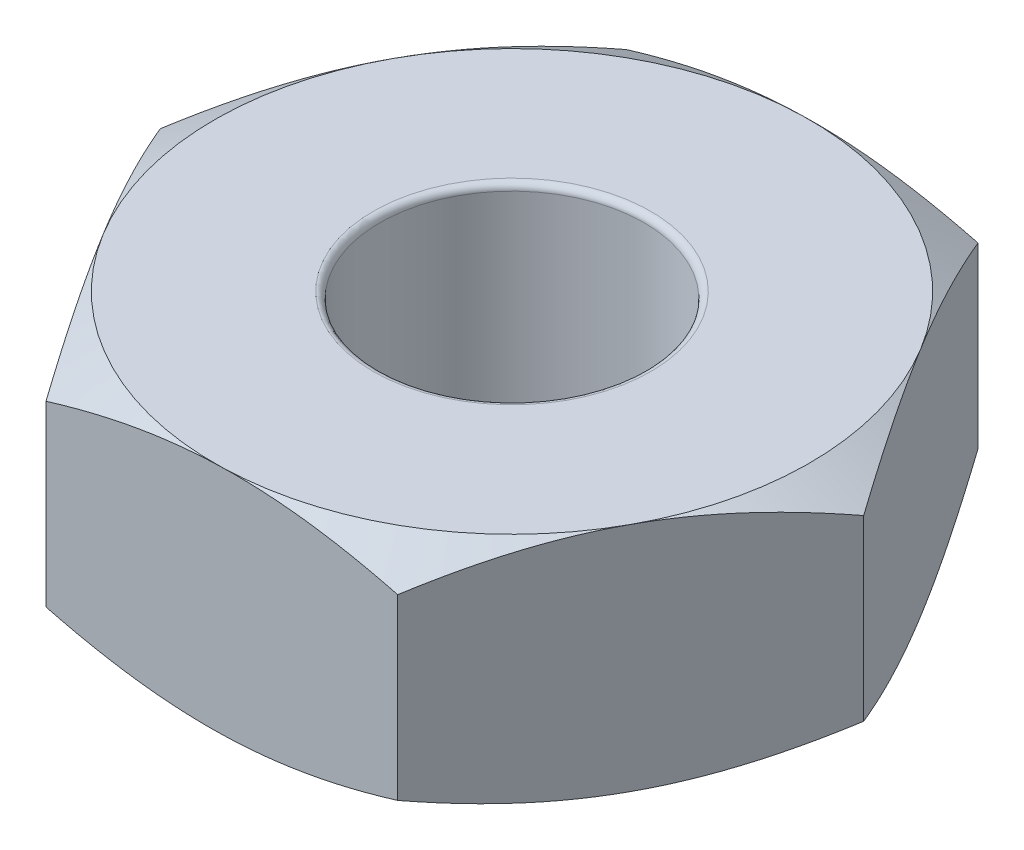
ISO-10303-21;
HEADER;
FILE_DESCRIPTION(('STEP AP214'),'2;1');
FILE_NAME('part.step','',(''),(''),'','','');
FILE_SCHEMA(('AUTOMOTIVE_DESIGN { 1 0 10303 214 1 1 1 1 }'));
ENDSEC;
DATA;
#1=APPLICATION_CONTEXT('core data for automotive mechanical design processes');
#2=APPLICATION_PROTOCOL_DEFINITION('international standard','automotive_design',2000,#1);
#3=PRODUCT_CONTEXT('',#1,'mechanical');
#4=PRODUCT('Part','Part','',(#3));
#5=PRODUCT_RELATED_PRODUCT_CATEGORY('part','',(#4));
#6=PRODUCT_DEFINITION_FORMATION('','',#4);
#7=PRODUCT_DEFINITION_CONTEXT('part definition',#1,'design');
#8=PRODUCT_DEFINITION('design','',#6,#7);
#9=PRODUCT_DEFINITION_SHAPE('','',#8);
#10=(LENGTH_UNIT() NAMED_UNIT(*) SI_UNIT(.MILLI.,.METRE.));
#11=(NAMED_UNIT(*) PLANE_ANGLE_UNIT() SI_UNIT($,.RADIAN.));
#12=(NAMED_UNIT(*) SI_UNIT($,.STERADIAN.) SOLID_ANGLE_UNIT());
#13=UNCERTAINTY_MEASURE_WITH_UNIT(LENGTH_MEASURE(1.E-05),#10,'distance_accuracy_value','');
#14=(GEOMETRIC_REPRESENTATION_CONTEXT(3) GLOBAL_UNCERTAINTY_ASSIGNED_CONTEXT((#13)) GLOBAL_UNIT_ASSIGNED_CONTEXT((#10,
#11,#12)) REPRESENTATION_CONTEXT('',''));
#15=CARTESIAN_POINT('',(0.,0.,0.));
#16=DIRECTION('',(0.,0.,1.));
#17=DIRECTION('',(1.,0.,0.));
#18=AXIS2_PLACEMENT_3D('',#15,#16,#17);
#19=CARTESIAN_POINT('',(-1.24414815732312,1.75,2.28081024257378));
#20=DIRECTION('',(-0.0242260833991026,0.,-0.999706505372022));
#21=DIRECTION('',(-0.999706505372022,0.,0.0242260833991026));
#22=AXIS2_PLACEMENT_3D('',#19,#20,#21);
#23=PLANE('',#22);
#24=CARTESIAN_POINT('',(1.35336553261908,0.201019649635317,2.21786418496117));
#25=CARTESIAN_POINT('',(1.2392259505726,0.168047394448406,2.22063015179137));
#26=CARTESIAN_POINT('',(1.12410112472943,0.138060129539284,2.22341999422733));
#27=CARTESIAN_POINT('',(0.891857888572226,0.0857165965177254,2.22904799002188));
#28=CARTESIAN_POINT('',(0.774735351050521,0.0633788464184081,2.23188624339591));
#29=CARTESIAN_POINT('',(0.541941818263342,0.028606252961392,2.2375275746364));
#30=CARTESIAN_POINT('',(0.426306644977155,0.0159399903113582,2.24032978442182));
#31=CARTESIAN_POINT('',(0.194492083865566,0.000818011110303956,2.2459473920501));
#32=CARTESIAN_POINT('',(0.0783135388495203,-0.0016502265858114,2.24876276946899));
#33=CARTESIAN_POINT('',(-0.138779970216544,0.00347945694205818,2.25402363896196));
#34=CARTESIAN_POINT('',(-0.239727401639467,0.00981786532235383,2.25646991782424));
#35=CARTESIAN_POINT('',(-0.440964580060728,0.0299084862872923,2.26134653775343));
#36=CARTESIAN_POINT('',(-0.541253630809851,0.04366756452077,2.26377686194799));
#37=CARTESIAN_POINT('',(-0.742905857206265,0.0780648199818089,2.26866353981599));
#38=CARTESIAN_POINT('',(-0.844243505302335,0.0988488331916787,2.27111927487528));
#39=CARTESIAN_POINT('',(-1.04540721139907,0.146020609597032,2.27599411433525));
#40=CARTESIAN_POINT('',(-1.14523584741224,0.172397286148404,2.2784132812094));
#41=CARTESIAN_POINT('',(-1.24434815732312,0.201019649635317,2.28081508921293));
#42=B_SPLINE_CURVE_WITH_KNOTS('',3,(#24,#25,#26,#27,#28,#29,#30,#31,#32,#33,#34,#35,#36,#37,#38,
#39,#40,#41),.UNSPECIFIED.,.F.,.F.,(4,2,2,2,2,2,2,2,4),(0.,0.356656711380072,0.714170816042071,
1.06283621827876,1.41107340134424,1.71431219010751,2.01783201974146,2.32808519638575,
2.63772899709812),.UNSPECIFIED.);
#43=CARTESIAN_POINT('',(1.35316553261908,0.200961894323341,2.21786903160031));
#44=VERTEX_POINT('',#43);
#45=CARTESIAN_POINT('',(0.0545086876479809,0.,2.24933963708705));
#46=VERTEX_POINT('',#45);
#47=EDGE_CURVE('E135',#44,#46,#42,.T.);
#48=ORIENTED_EDGE('',*,*,#47,.F.);
#49=DIRECTION('',(0.,-1.,0.));
#50=VECTOR('',#49,1.);
#51=CARTESIAN_POINT('',(1.35316553261908,1.75,2.21786903160031));
#52=LINE('',#51,#50);
#53=CARTESIAN_POINT('',(1.35316553261908,1.54903810567666,2.21786903160031));
#54=VERTEX_POINT('',#53);
#55=EDGE_CURVE('E248',#54,#44,#52,.T.);
#56=ORIENTED_EDGE('',*,*,#55,.F.);
#57=CARTESIAN_POINT('',(-1.24434815732312,1.54898035036468,2.28081508921293));
#58=CARTESIAN_POINT('',(-1.13020857527664,1.58195260555159,2.27804912238272));
#59=CARTESIAN_POINT('',(-1.01508374943347,1.61193987046072,2.27525927994677));
#60=CARTESIAN_POINT('',(-0.782840513276265,1.66428340348227,2.26963128415222));
#61=CARTESIAN_POINT('',(-0.665717975754561,1.68662115358159,2.26679303077818));
#62=CARTESIAN_POINT('',(-0.432924442967381,1.72139374703861,2.2611516995377));
#63=CARTESIAN_POINT('',(-0.317289269681194,1.73406000968864,2.25834948975228));
#64=CARTESIAN_POINT('',(-0.085474708569605,1.7491819888897,2.252731882124));
#65=CARTESIAN_POINT('',(0.0307038364464405,1.75165022658581,2.24991650470511));
#66=CARTESIAN_POINT('',(0.247797345512505,1.74652054305794,2.24465563521213));
#67=CARTESIAN_POINT('',(0.348744776935427,1.74018213467765,2.24220935634985));
#68=CARTESIAN_POINT('',(0.549981955356688,1.72009151371271,2.23733273642067));
#69=CARTESIAN_POINT('',(0.650271006105811,1.70633243547923,2.23490241222611));
#70=CARTESIAN_POINT('',(0.851923232502226,1.67193518001819,2.23001573435811));
#71=CARTESIAN_POINT('',(0.953260880598296,1.65115116680832,2.22755999929882));
#72=CARTESIAN_POINT('',(1.15442458669503,1.60397939040297,2.22268515983885));
#73=CARTESIAN_POINT('',(1.2542532227082,1.5776027138516,2.2202659929647));
#74=CARTESIAN_POINT('',(1.35336553261908,1.54898035036468,2.21786418496117));
#75=B_SPLINE_CURVE_WITH_KNOTS('',3,(#57,#58,#59,#60,#61,#62,#63,#64,#65,#66,#67,#68,#69,#70,#71,
#72,#73,#74),.UNSPECIFIED.,.F.,.F.,(4,2,2,2,2,2,2,2,4),(0.,0.356656711380072,0.714170816042071,
1.06283621827877,1.41107340134425,1.71431219010751,2.01783201974146,2.32808519638575,
2.63772899709812),.UNSPECIFIED.);
#76=CARTESIAN_POINT('',(0.0545086876479809,1.75,2.24933963708705));
#77=VERTEX_POINT('',#76);
#78=EDGE_CURVE('E421',#77,#54,#75,.T.);
#79=ORIENTED_EDGE('',*,*,#78,.F.);
#80=CARTESIAN_POINT('',(-1.24414815732312,1.54903810567666,2.28081024257378));
#81=VERTEX_POINT('',#80);
#82=EDGE_CURVE('E407',#81,#77,#75,.T.);
#83=ORIENTED_EDGE('',*,*,#82,.F.);
#84=DIRECTION('',(0.,-1.,0.));
#85=VECTOR('',#84,1.);
#86=CARTESIAN_POINT('',(-1.24414815732312,1.75,2.28081024257378));
#87=LINE('',#86,#85);
#88=CARTESIAN_POINT('',(-1.24414815732312,0.200961894323341,2.28081024257378));
#89=VERTEX_POINT('',#88);
#90=EDGE_CURVE('E173',#81,#89,#87,.T.);
#91=ORIENTED_EDGE('',*,*,#90,.T.);
#92=EDGE_CURVE('E149',#46,#89,#42,.T.);
#93=ORIENTED_EDGE('',*,*,#92,.F.);
#94=EDGE_LOOP('',(#48,#56,#79,#83,#91,#93));
#95=FACE_BOUND('',#94,.T.);
#96=ADVANCED_FACE('F45',(#95),#23,.F.);
#97=CARTESIAN_POINT('',(1.35316553261908,1.75,2.21786903160031));
#98=DIRECTION('',(-0.877884271680286,0.,-0.478872849028187));
#99=DIRECTION('',(-0.478872849028188,0.,0.877884271680286));
#100=AXIS2_PLACEMENT_3D('',#97,#98,#99);
#101=PLANE('',#100);
#102=CARTESIAN_POINT('',(2.59742278697572,0.201027664750746,-0.0631412109734704));
#103=CARTESIAN_POINT('',(2.54274816911693,0.168054751331238,0.0370899614050852));
#104=CARTESIAN_POINT('',(2.48760160480089,0.13806678726465,0.138186320383265));
#105=CARTESIAN_POINT('',(2.37635350022435,0.0857218031429434,0.342129729286452));
#106=CARTESIAN_POINT('',(2.32024998283202,0.0633833020133519,0.444980403749666));
#107=CARTESIAN_POINT('',(2.20873826610772,0.0286092238229332,0.649407074459846));
#108=CARTESIAN_POINT('',(2.15334722697362,0.0159422229400709,0.750951612110147));
#109=CARTESIAN_POINT('',(2.04230443514268,0.000818816864933552,0.954518635443553));
#110=CARTESIAN_POINT('',(1.98665308621816,-0.00165011007630418,1.05654038091894));
#111=CARTESIAN_POINT('',(1.88266013136103,0.00347848396653262,1.24718342869227));
#112=CARTESIAN_POINT('',(1.83430298004151,0.00981675884907256,1.33583322926631));
#113=CARTESIAN_POINT('',(1.73790373292515,0.0299077409451317,1.51255526104785));
#114=CARTESIAN_POINT('',(1.68986197070406,0.0436673152428587,1.60062688073413));
#115=CARTESIAN_POINT('',(1.59326386997476,0.0780661193384383,1.777713457007));
#116=CARTESIAN_POINT('',(1.54471976124752,0.0988512050500394,1.86670599358715));
#117=CARTESIAN_POINT('',(1.44835568410154,0.14602553399345,2.04336355070931));
#118=CARTESIAN_POINT('',(1.40053448053916,0.172403688555852,2.13103083555418));
#119=CARTESIAN_POINT('',(1.35305643558557,0.201027664750746,2.21806903160031));
#120=B_SPLINE_CURVE_WITH_KNOTS('',3,(#102,#103,#104,#105,#106,#107,#108,#109,#110,#111,#112,
#113,#114,#115,#116,#117,#118,#119),.UNSPECIFIED.,.F.,.F.,(4,2,2,2,2,2,2,2,4),(0.,
0.356658612393827,0.714174670128739,1.0628417917424,1.41108067343755,1.71433174766822,
2.01786390910348,2.32813007022043,2.63778676329003),.UNSPECIFIED.);
#121=CARTESIAN_POINT('',(2.59731368994221,0.200961894323341,-0.0629412109734703));
#122=VERTEX_POINT('',#121);
#123=CARTESIAN_POINT('',(1.97523961128064,0.,1.07746391031342));
#124=VERTEX_POINT('',#123);
#125=EDGE_CURVE('E61',#122,#124,#120,.T.);
#126=ORIENTED_EDGE('',*,*,#125,.F.);
#127=DIRECTION('',(0.,-1.,0.));
#128=VECTOR('',#127,1.);
#129=CARTESIAN_POINT('',(2.59731368994221,1.75,-0.0629412109734704));
#130=LINE('',#129,#128);
#131=CARTESIAN_POINT('',(2.59731368994221,1.54903810567666,-0.0629412109734704));
#132=VERTEX_POINT('',#131);
#133=EDGE_CURVE('E411',#132,#122,#130,.T.);
#134=ORIENTED_EDGE('',*,*,#133,.F.);
#135=CARTESIAN_POINT('',(1.35305643558557,1.54897233524925,2.21806903160031));
#136=CARTESIAN_POINT('',(1.40773105344435,1.58194524866876,2.11783785922176));
#137=CARTESIAN_POINT('',(1.4628776177604,1.61193321273535,2.01674150024358));
#138=CARTESIAN_POINT('',(1.57412572233694,1.66427819685706,1.81279809134039));
#139=CARTESIAN_POINT('',(1.63022923972927,1.68661669798665,1.70994741687718));
#140=CARTESIAN_POINT('',(1.74174095645357,1.72139077617707,1.505520746167));
#141=CARTESIAN_POINT('',(1.79713199558767,1.73405777705993,1.4039762085167));
#142=CARTESIAN_POINT('',(1.90817478741861,1.74918118313507,1.20040918518329));
#143=CARTESIAN_POINT('',(1.96382613634313,1.7516501100763,1.0983874397079));
#144=CARTESIAN_POINT('',(2.06781909120026,1.74652151603347,0.907744391934576));
#145=CARTESIAN_POINT('',(2.11617624251978,1.74018324115093,0.819094591360529));
#146=CARTESIAN_POINT('',(2.21257548963614,1.72009225905487,0.642372559578993));
#147=CARTESIAN_POINT('',(2.26061725185723,1.70633268475714,0.554300939892715));
#148=CARTESIAN_POINT('',(2.35721535258653,1.67193388066156,0.377214363619842));
#149=CARTESIAN_POINT('',(2.40575946131376,1.65114879494996,0.288221827039693));
#150=CARTESIAN_POINT('',(2.50212353845975,1.60397446600655,0.111564269917535));
#151=CARTESIAN_POINT('',(2.54994474202212,1.57759631144415,0.0238969850726663));
#152=CARTESIAN_POINT('',(2.59742278697572,1.54897233524925,-0.0631412109734705));
#153=B_SPLINE_CURVE_WITH_KNOTS('',3,(#135,#136,#137,#138,#139,#140,#141,#142,#143,#144,#145,
#146,#147,#148,#149,#150,#151,#152),.UNSPECIFIED.,.F.,.F.,(4,2,2,2,2,2,2,2,4),(0.,
0.356658612393827,0.714174670128739,1.0628417917424,1.41108067343755,1.71433174766822,
2.01786390910348,2.32813007022043,2.63778676329003),.UNSPECIFIED.);
#154=CARTESIAN_POINT('',(1.97523961128064,1.75,1.07746391031342));
#155=VERTEX_POINT('',#154);
#156=EDGE_CURVE('E298',#155,#132,#153,.T.);
#157=ORIENTED_EDGE('',*,*,#156,.F.);
#158=EDGE_CURVE('E420',#54,#155,#153,.T.);
#159=ORIENTED_EDGE('',*,*,#158,.F.);
#160=ORIENTED_EDGE('',*,*,#55,.T.);
#161=EDGE_CURVE('E142',#124,#44,#120,.T.);
#162=ORIENTED_EDGE('',*,*,#161,.F.);
#163=EDGE_LOOP('',(#126,#134,#157,#159,#160,#162));
#164=FACE_BOUND('',#163,.T.);
#165=ADVANCED_FACE('F283',(#164),#101,.F.);
#166=CARTESIAN_POINT('',(2.59731368994221,1.75,-0.0629412109734704));
#167=DIRECTION('',(-0.853658188281184,0.,0.520833656343834));
#168=DIRECTION('',(0.520833656343834,0.,0.853658188281184));
#169=AXIS2_PLACEMENT_3D('',#166,#167,#168);
#170=PLANE('',#169);
#171=CARTESIAN_POINT('',(1.24402613338813,0.201029531384988,-2.28101024257378));
#172=CARTESIAN_POINT('',(1.3034916228234,0.168056464671943,-2.18354495522483));
#173=CARTESIAN_POINT('',(1.36347041296902,0.138068337780994,-2.08523835635709));
#174=CARTESIAN_POINT('',(1.48446665374401,0.0857230157174111,-1.88692277050597));
#175=CARTESIAN_POINT('',(1.54548625478608,0.0633843396827904,-1.78691025894733));
#176=CARTESIAN_POINT('',(1.6667692096972,0.0286099157173191,-1.58812474211724));
#177=CARTESIAN_POINT('',(1.72701389947093,0.0159427429095415,-1.48938232772177));
#178=CARTESIAN_POINT('',(1.84778684433711,0.000819004533354107,-1.29143272893512));
#179=CARTESIAN_POINT('',(1.90831466026302,-0.00165008292465321,-1.19222626434786));
#180=CARTESIAN_POINT('',(2.02142047439859,0.00347825738428889,-1.00684326691096));
#181=CARTESIAN_POINT('',(2.07401537839305,0.00981650117229507,-0.92063902509619));
#182=CARTESIAN_POINT('',(2.17886252038582,0.0299075673656625,-0.74879217881458));
#183=CARTESIAN_POINT('',(2.23111439556314,0.0436672571895414,-0.663150169019585));
#184=CARTESIAN_POINT('',(2.33617782568627,0.0780664219434196,-0.490948821581496));
#185=CARTESIAN_POINT('',(2.38897607878643,0.0988517574292066,-0.404411285965429));
#186=CARTESIAN_POINT('',(2.49378497521699,0.146026680831881,-0.232627125028653));
#187=CARTESIAN_POINT('',(2.54579696198041,0.172405179607658,-0.147378297790703));
#188=CARTESIAN_POINT('',(2.59743571387719,0.201029531384988,-0.0627412109734703));
#189=B_SPLINE_CURVE_WITH_KNOTS('',3,(#171,#172,#173,#174,#175,#176,#177,#178,#179,#180,#181,
#182,#183,#184,#185,#186,#187,#188),.UNSPECIFIED.,.F.,.F.,(4,2,2,2,2,2,2,2,4),(0.,
0.356659055119231,0.714175567703559,1.06284308974171,1.41108236702949,1.71433630238094,
2.01787133572819,2.32814052076081,2.63780021629238),.UNSPECIFIED.);
#190=CARTESIAN_POINT('',(1.24414815732312,0.200961894323341,-2.28081024257378));
#191=VERTEX_POINT('',#190);
#192=CARTESIAN_POINT('',(1.92073092363266,0.,-1.17187572677363));
#193=VERTEX_POINT('',#192);
#194=EDGE_CURVE('E69',#191,#193,#189,.T.);
#195=ORIENTED_EDGE('',*,*,#194,.F.);
#196=DIRECTION('',(0.,-1.,0.));
#197=VECTOR('',#196,1.);
#198=CARTESIAN_POINT('',(1.24414815732312,1.75,-2.28081024257378));
#199=LINE('',#198,#197);
#200=CARTESIAN_POINT('',(1.24414815732312,1.54903810567666,-2.28081024257378));
#201=VERTEX_POINT('',#200);
#202=EDGE_CURVE('E405',#201,#191,#199,.T.);
#203=ORIENTED_EDGE('',*,*,#202,.F.);
#204=CARTESIAN_POINT('',(2.59743571387719,1.54897046861501,-0.0627412109734704));
#205=CARTESIAN_POINT('',(2.53797022444193,1.58194353532806,-0.160206498322428));
#206=CARTESIAN_POINT('',(2.47799143429631,1.61193166221901,-0.25851309719016));
#207=CARTESIAN_POINT('',(2.35699519352132,1.66427698428259,-0.456828683041287));
#208=CARTESIAN_POINT('',(2.29597559247925,1.68661566031721,-0.556841194599921));
#209=CARTESIAN_POINT('',(2.17469263756813,1.72139008428268,-0.755626711430012));
#210=CARTESIAN_POINT('',(2.11444794779439,1.73405725709046,-0.854369125825481));
#211=CARTESIAN_POINT('',(1.99367500292821,1.74918099546665,-1.05231872461213));
#212=CARTESIAN_POINT('',(1.9331471870023,1.75165008292465,-1.1515251891994));
#213=CARTESIAN_POINT('',(1.82004137286673,1.74652174261571,-1.33690818663629));
#214=CARTESIAN_POINT('',(1.76744646887227,1.7401834988277,-1.42311242845106));
#215=CARTESIAN_POINT('',(1.6625993268795,1.72009243263434,-1.59495927473267));
#216=CARTESIAN_POINT('',(1.61034745170219,1.70633274281046,-1.68060128452767));
#217=CARTESIAN_POINT('',(1.50528402157906,1.67193357805658,-1.85280263196576));
#218=CARTESIAN_POINT('',(1.45248576847889,1.65114824257079,-1.93934016758182));
#219=CARTESIAN_POINT('',(1.34767687204834,1.60397331916812,-2.1111243285186));
#220=CARTESIAN_POINT('',(1.29566488528492,1.57759482039234,-2.19637315575655));
#221=CARTESIAN_POINT('',(1.24402613338813,1.54897046861501,-2.28101024257378));
#222=B_SPLINE_CURVE_WITH_KNOTS('',3,(#204,#205,#206,#207,#208,#209,#210,#211,#212,#213,#214,
#215,#216,#217,#218,#219,#220,#221),.UNSPECIFIED.,.F.,.F.,(4,2,2,2,2,2,2,2,4),(0.,
0.356659055119231,0.714175567703558,1.06284308974171,1.41108236702949,1.71433630238094,
2.01787133572819,2.32814052076081,2.63780021629238),.UNSPECIFIED.);
#223=CARTESIAN_POINT('',(1.92073092363266,1.75,-1.17187572677363));
#224=VERTEX_POINT('',#223);
#225=EDGE_CURVE('E360',#224,#201,#222,.T.);
#226=ORIENTED_EDGE('',*,*,#225,.F.);
#227=EDGE_CURVE('E431',#132,#224,#222,.T.);
#228=ORIENTED_EDGE('',*,*,#227,.F.);
#229=ORIENTED_EDGE('',*,*,#133,.T.);
#230=EDGE_CURVE('E213',#193,#122,#189,.T.);
#231=ORIENTED_EDGE('',*,*,#230,.F.);
#232=EDGE_LOOP('',(#195,#203,#226,#228,#229,#231));
#233=FACE_BOUND('',#232,.T.);
#234=ADVANCED_FACE('F287',(#233),#170,.F.);
#235=CARTESIAN_POINT('',(1.24414815732312,1.75,-2.28081024257378));
#236=DIRECTION('',(0.0242260833991023,0.,0.999706505372022));
#237=DIRECTION('',(0.999706505372022,0.,-0.0242260833991023));
#238=AXIS2_PLACEMENT_3D('',#235,#236,#237);
#239=PLANE('',#238);
#240=CARTESIAN_POINT('',(-1.35336553261908,0.201019649635318,-2.21786418496117));
#241=CARTESIAN_POINT('',(-1.23922595057261,0.168047394448406,-2.22063015179137));
#242=CARTESIAN_POINT('',(-1.12410112472943,0.138060129539285,-2.22341999422733));
#243=CARTESIAN_POINT('',(-0.891857888572227,0.0857165965177261,-2.22904799002188));
#244=CARTESIAN_POINT('',(-0.774735351050522,0.0633788464184088,-2.23188624339591));
#245=CARTESIAN_POINT('',(-0.541941818263342,0.0286062529613925,-2.2375275746364));
#246=CARTESIAN_POINT('',(-0.426306644977155,0.0159399903113585,-2.24032978442182));
#247=CARTESIAN_POINT('',(-0.194492083865566,0.000818011110304187,-2.2459473920501));
#248=CARTESIAN_POINT('',(-0.0783135388495208,-0.00165022658581117,-2.24876276946899));
#249=CARTESIAN_POINT('',(0.138779970216544,0.00347945694205843,-2.25402363896196));
#250=CARTESIAN_POINT('',(0.239727401639466,0.00981786532235409,-2.25646991782424));
#251=CARTESIAN_POINT('',(0.440964580060727,0.0299084862872924,-2.26134653775343));
#252=CARTESIAN_POINT('',(0.54125363080985,0.0436675645207699,-2.26377686194799));
#253=CARTESIAN_POINT('',(0.742905857206264,0.0780648199818087,-2.26866353981599));
#254=CARTESIAN_POINT('',(0.844243505302334,0.0988488331916787,-2.27111927487528));
#255=CARTESIAN_POINT('',(1.04540721139906,0.146020609597032,-2.27599411433525));
#256=CARTESIAN_POINT('',(1.14523584741224,0.172397286148404,-2.2784132812094));
#257=CARTESIAN_POINT('',(1.24434815732312,0.201019649635317,-2.28081508921293));
#258=B_SPLINE_CURVE_WITH_KNOTS('',3,(#240,#241,#242,#243,#244,#245,#246,#247,#248,#249,#250,
#251,#252,#253,#254,#255,#256,#257),.UNSPECIFIED.,.F.,.F.,(4,2,2,2,2,2,2,2,4),(0.,
0.356656711380072,0.714170816042071,1.06283621827877,1.41107340134425,1.71431219010751,
2.01783201974146,2.32808519638575,2.63772899709812),.UNSPECIFIED.);
#259=CARTESIAN_POINT('',(-1.35316553261908,0.200961894323342,-2.21786903160031));
#260=VERTEX_POINT('',#259);
#261=CARTESIAN_POINT('',(-0.0545086876479801,0.,-2.24933963708705));
#262=VERTEX_POINT('',#261);
#263=EDGE_CURVE('E191',#260,#262,#258,.T.);
#264=ORIENTED_EDGE('',*,*,#263,.F.);
#265=DIRECTION('',(0.,-1.,0.));
#266=VECTOR('',#265,1.);
#267=CARTESIAN_POINT('',(-1.35316553261908,1.75,-2.21786903160031));
#268=LINE('',#267,#266);
#269=CARTESIAN_POINT('',(-1.35316553261908,1.54903810567666,-2.21786903160031));
#270=VERTEX_POINT('',#269);
#271=EDGE_CURVE('E368',#270,#260,#268,.T.);
#272=ORIENTED_EDGE('',*,*,#271,.F.);
#273=CARTESIAN_POINT('',(1.24434815732312,1.54898035036468,-2.28081508921293));
#274=CARTESIAN_POINT('',(1.13020857527664,1.58195260555159,-2.27804912238272));
#275=CARTESIAN_POINT('',(1.01508374943347,1.61193987046072,-2.27525927994677));
#276=CARTESIAN_POINT('',(0.782840513276264,1.66428340348227,-2.26963128415222));
#277=CARTESIAN_POINT('',(0.66571797575456,1.68662115358159,-2.26679303077818));
#278=CARTESIAN_POINT('',(0.43292444296738,1.72139374703861,-2.2611516995377));
#279=CARTESIAN_POINT('',(0.317289269681193,1.73406000968864,-2.25834948975228));
#280=CARTESIAN_POINT('',(0.0854747085696044,1.7491819888897,-2.252731882124));
#281=CARTESIAN_POINT('',(-0.0307038364464412,1.75165022658581,-2.24991650470511));
#282=CARTESIAN_POINT('',(-0.247797345512506,1.74652054305794,-2.24465563521213));
#283=CARTESIAN_POINT('',(-0.348744776935428,1.74018213467765,-2.24220935634985));
#284=CARTESIAN_POINT('',(-0.549981955356689,1.72009151371271,-2.23733273642067));
#285=CARTESIAN_POINT('',(-0.650271006105812,1.70633243547923,-2.23490241222611));
#286=CARTESIAN_POINT('',(-0.851923232502227,1.67193518001819,-2.23001573435811));
#287=CARTESIAN_POINT('',(-0.953260880598297,1.65115116680832,-2.22755999929882));
#288=CARTESIAN_POINT('',(-1.15442458669503,1.60397939040297,-2.22268515983885));
#289=CARTESIAN_POINT('',(-1.2542532227082,1.5776027138516,-2.2202659929647));
#290=CARTESIAN_POINT('',(-1.35336553261908,1.54898035036468,-2.21786418496117));
#291=B_SPLINE_CURVE_WITH_KNOTS('',3,(#273,#274,#275,#276,#277,#278,#279,#280,#281,#282,#283,
#284,#285,#286,#287,#288,#289,#290),.UNSPECIFIED.,.F.,.F.,(4,2,2,2,2,2,2,2,4),(0.,
0.356656711380072,0.714170816042071,1.06283621827876,1.41107340134425,1.71431219010751,
2.01783201974146,2.32808519638575,2.63772899709812),.UNSPECIFIED.);
#292=CARTESIAN_POINT('',(-0.0545086876479801,1.75,-2.24933963708705));
#293=VERTEX_POINT('',#292);
#294=EDGE_CURVE('E351',#293,#270,#291,.T.);
#295=ORIENTED_EDGE('',*,*,#294,.F.);
#296=EDGE_CURVE('E356',#201,#293,#291,.T.);
#297=ORIENTED_EDGE('',*,*,#296,.F.);
#298=ORIENTED_EDGE('',*,*,#202,.T.);
#299=EDGE_CURVE('E312',#262,#191,#258,.T.);
#300=ORIENTED_EDGE('',*,*,#299,.F.);
#301=EDGE_LOOP('',(#264,#272,#295,#297,#298,#300));
#302=FACE_BOUND('',#301,.T.);
#303=ADVANCED_FACE('F292',(#302),#239,.F.);
#304=CARTESIAN_POINT('',(-1.35316553261908,1.75,-2.21786903160031));
#305=DIRECTION('',(0.877884271680286,0.,0.478872849028187));
#306=DIRECTION('',(0.478872849028187,0.,-0.877884271680286));
#307=AXIS2_PLACEMENT_3D('',#304,#305,#306);
#308=PLANE('',#307);
#309=CARTESIAN_POINT('',(-2.59742278697572,0.201027664750746,0.06314121097347));
#310=CARTESIAN_POINT('',(-2.54274816911693,0.168054751331238,-0.0370899614050854));
#311=CARTESIAN_POINT('',(-2.48760160480089,0.138066787264649,-0.138186320383266));
#312=CARTESIAN_POINT('',(-2.37635350022435,0.0857218031429435,-0.342129729286452));
#313=CARTESIAN_POINT('',(-2.32024998283202,0.0633833020133523,-0.444980403749667));
#314=CARTESIAN_POINT('',(-2.20873826610772,0.0286092238229336,-0.649407074459847));
#315=CARTESIAN_POINT('',(-2.15334722697362,0.0159422229400712,-0.750951612110148));
#316=CARTESIAN_POINT('',(-2.04230443514268,0.000818816864933883,-0.954518635443553));
#317=CARTESIAN_POINT('',(-1.98665308621816,-0.00165011007630369,-1.05654038091894));
#318=CARTESIAN_POINT('',(-1.88266013136103,0.00347848396653313,-1.24718342869227));
#319=CARTESIAN_POINT('',(-1.83430298004151,0.00981675884907299,-1.33583322926631));
#320=CARTESIAN_POINT('',(-1.73790373292515,0.029907740945132,-1.51255526104785));
#321=CARTESIAN_POINT('',(-1.68986197070406,0.0436673152428591,-1.60062688073413));
#322=CARTESIAN_POINT('',(-1.59326386997476,0.0780661193384389,-1.777713457007));
#323=CARTESIAN_POINT('',(-1.54471976124752,0.09885120505004,-1.86670599358715));
#324=CARTESIAN_POINT('',(-1.44835568410154,0.146025533993451,-2.04336355070931));
#325=CARTESIAN_POINT('',(-1.40053448053917,0.172403688555852,-2.13103083555418));
#326=CARTESIAN_POINT('',(-1.35305643558557,0.201027664750746,-2.21806903160031));
#327=B_SPLINE_CURVE_WITH_KNOTS('',3,(#309,#310,#311,#312,#313,#314,#315,#316,#317,#318,#319,
#320,#321,#322,#323,#324,#325,#326),.UNSPECIFIED.,.F.,.F.,(4,2,2,2,2,2,2,2,4),(0.,
0.356658612393826,0.714174670128739,1.0628417917424,1.41108067343755,1.71433174766822,
2.01786390910348,2.32813007022043,2.63778676329003),.UNSPECIFIED.);
#328=CARTESIAN_POINT('',(-2.59731368994221,0.200961894323341,0.0629412109734698));
#329=VERTEX_POINT('',#328);
#330=CARTESIAN_POINT('',(-1.97523961128064,0.,-1.07746391031342));
#331=VERTEX_POINT('',#330);
#332=EDGE_CURVE('E175',#329,#331,#327,.T.);
#333=ORIENTED_EDGE('',*,*,#332,.F.);
#334=DIRECTION('',(0.,-1.,0.));
#335=VECTOR('',#334,1.);
#336=CARTESIAN_POINT('',(-2.59731368994221,1.75,0.0629412109734698));
#337=LINE('',#336,#335);
#338=CARTESIAN_POINT('',(-2.59731368994221,1.54903810567666,0.0629412109734698));
#339=VERTEX_POINT('',#338);
#340=EDGE_CURVE('E396',#339,#329,#337,.T.);
#341=ORIENTED_EDGE('',*,*,#340,.F.);
#342=CARTESIAN_POINT('',(-1.35305643558557,1.54897233524925,-2.21806903160031));
#343=CARTESIAN_POINT('',(-1.40773105344436,1.58194524866876,-2.11783785922176));
#344=CARTESIAN_POINT('',(-1.4628776177604,1.61193321273535,-2.01674150024358));
#345=CARTESIAN_POINT('',(-1.57412572233694,1.66427819685706,-1.81279809134039));
#346=CARTESIAN_POINT('',(-1.63022923972927,1.68661669798665,-1.70994741687718));
#347=CARTESIAN_POINT('',(-1.74174095645357,1.72139077617707,-1.505520746167));
#348=CARTESIAN_POINT('',(-1.79713199558767,1.73405777705993,-1.4039762085167));
#349=CARTESIAN_POINT('',(-1.90817478741861,1.74918118313507,-1.20040918518329));
#350=CARTESIAN_POINT('',(-1.96382613634313,1.7516501100763,-1.0983874397079));
#351=CARTESIAN_POINT('',(-2.06781909120026,1.74652151603347,-0.907744391934575));
#352=CARTESIAN_POINT('',(-2.11617624251978,1.74018324115093,-0.819094591360529));
#353=CARTESIAN_POINT('',(-2.21257548963614,1.72009225905487,-0.642372559578992));
#354=CARTESIAN_POINT('',(-2.26061725185723,1.70633268475714,-0.554300939892715));
#355=CARTESIAN_POINT('',(-2.35721535258653,1.67193388066156,-0.377214363619842));
#356=CARTESIAN_POINT('',(-2.40575946131377,1.65114879494996,-0.288221827039693));
#357=CARTESIAN_POINT('',(-2.50212353845975,1.60397446600655,-0.111564269917535));
#358=CARTESIAN_POINT('',(-2.54994474202212,1.57759631144415,-0.0238969850726669));
#359=CARTESIAN_POINT('',(-2.59742278697572,1.54897233524925,0.0631412109734699));
#360=B_SPLINE_CURVE_WITH_KNOTS('',3,(#342,#343,#344,#345,#346,#347,#348,#349,#350,#351,#352,
#353,#354,#355,#356,#357,#358,#359),.UNSPECIFIED.,.F.,.F.,(4,2,2,2,2,2,2,2,4),(0.,
0.356658612393827,0.714174670128739,1.0628417917424,1.41108067343755,1.71433174766822,
2.01786390910348,2.32813007022043,2.63778676329003),.UNSPECIFIED.);
#361=CARTESIAN_POINT('',(-1.97523961128065,1.75,-1.07746391031342));
#362=VERTEX_POINT('',#361);
#363=EDGE_CURVE('E334',#362,#339,#360,.T.);
#364=ORIENTED_EDGE('',*,*,#363,.F.);
#365=EDGE_CURVE('E340',#270,#362,#360,.T.);
#366=ORIENTED_EDGE('',*,*,#365,.F.);
#367=ORIENTED_EDGE('',*,*,#271,.T.);
#368=EDGE_CURVE('E148',#331,#260,#327,.T.);
#369=ORIENTED_EDGE('',*,*,#368,.F.);
#370=EDGE_LOOP('',(#333,#341,#364,#366,#367,#369));
#371=FACE_BOUND('',#370,.T.);
#372=ADVANCED_FACE('F235',(#371),#308,.F.);
#373=CARTESIAN_POINT('',(-2.59731368994221,1.75,0.0629412109734698));
#374=DIRECTION('',(0.853658188281184,0.,-0.520833656343834));
#375=DIRECTION('',(-0.520833656343834,0.,-0.853658188281184));
#376=AXIS2_PLACEMENT_3D('',#373,#374,#375);
#377=PLANE('',#376);
#378=CARTESIAN_POINT('',(-1.24402613338813,0.201029531384989,2.28101024257378));
#379=CARTESIAN_POINT('',(-1.3034916228234,0.168056464671943,2.18354495522483));
#380=CARTESIAN_POINT('',(-1.36347041296902,0.138068337780994,2.08523835635709));
#381=CARTESIAN_POINT('',(-1.48446665374401,0.0857230157174111,1.88692277050597));
#382=CARTESIAN_POINT('',(-1.54548625478608,0.0633843396827904,1.78691025894733));
#383=CARTESIAN_POINT('',(-1.6667692096972,0.0286099157173192,1.58812474211724));
#384=CARTESIAN_POINT('',(-1.72701389947093,0.0159427429095416,1.48938232772177));
#385=CARTESIAN_POINT('',(-1.84778684433711,0.000819004533354179,1.29143272893512));
#386=CARTESIAN_POINT('',(-1.90831466026302,-0.00165008292465315,1.19222626434786));
#387=CARTESIAN_POINT('',(-2.02142047439859,0.00347825738428885,1.00684326691096));
#388=CARTESIAN_POINT('',(-2.07401537839305,0.00981650117229496,0.92063902509619));
#389=CARTESIAN_POINT('',(-2.17886252038582,0.0299075673656625,0.748792178814579));
#390=CARTESIAN_POINT('',(-2.23111439556314,0.0436672571895415,0.663150169019585));
#391=CARTESIAN_POINT('',(-2.33617782568627,0.0780664219434197,0.490948821581495));
#392=CARTESIAN_POINT('',(-2.38897607878643,0.0988517574292068,0.404411285965429));
#393=CARTESIAN_POINT('',(-2.49378497521699,0.146026680831881,0.232627125028653));
#394=CARTESIAN_POINT('',(-2.54579696198041,0.172405179607658,0.147378297790702));
#395=CARTESIAN_POINT('',(-2.59743571387719,0.201029531384988,0.0627412109734697));
#396=B_SPLINE_CURVE_WITH_KNOTS('',3,(#378,#379,#380,#381,#382,#383,#384,#385,#386,#387,#388,
#389,#390,#391,#392,#393,#394,#395),.UNSPECIFIED.,.F.,.F.,(4,2,2,2,2,2,2,2,4),(0.,
0.356659055119231,0.714175567703559,1.06284308974171,1.41108236702949,1.71433630238094,
2.01787133572819,2.32814052076081,2.63780021629238),.UNSPECIFIED.);
#397=CARTESIAN_POINT('',(-1.92073092363266,0.,1.17187572677363));
#398=VERTEX_POINT('',#397);
#399=EDGE_CURVE('E156',#89,#398,#396,.T.);
#400=ORIENTED_EDGE('',*,*,#399,.F.);
#401=ORIENTED_EDGE('',*,*,#90,.F.);
#402=CARTESIAN_POINT('',(-2.59743571387719,1.54897046861501,0.0627412109734698));
#403=CARTESIAN_POINT('',(-2.53797022444193,1.58194353532806,0.160206498322428));
#404=CARTESIAN_POINT('',(-2.47799143429631,1.61193166221901,0.25851309719016));
#405=CARTESIAN_POINT('',(-2.35699519352132,1.66427698428259,0.456828683041286));
#406=CARTESIAN_POINT('',(-2.29597559247925,1.68661566031721,0.556841194599921));
#407=CARTESIAN_POINT('',(-2.17469263756813,1.72139008428268,0.755626711430012));
#408=CARTESIAN_POINT('',(-2.11444794779439,1.73405725709046,0.854369125825481));
#409=CARTESIAN_POINT('',(-1.99367500292821,1.74918099546665,1.05231872461213));
#410=CARTESIAN_POINT('',(-1.9331471870023,1.75165008292465,1.1515251891994));
#411=CARTESIAN_POINT('',(-1.82004137286673,1.74652174261571,1.33690818663629));
#412=CARTESIAN_POINT('',(-1.76744646887227,1.7401834988277,1.42311242845106));
#413=CARTESIAN_POINT('',(-1.6625993268795,1.72009243263434,1.59495927473267));
#414=CARTESIAN_POINT('',(-1.61034745170219,1.70633274281046,1.68060128452767));
#415=CARTESIAN_POINT('',(-1.50528402157906,1.67193357805658,1.85280263196576));
#416=CARTESIAN_POINT('',(-1.45248576847889,1.65114824257079,1.93934016758182));
#417=CARTESIAN_POINT('',(-1.34767687204834,1.60397331916812,2.1111243285186));
#418=CARTESIAN_POINT('',(-1.29566488528492,1.57759482039234,2.19637315575655));
#419=CARTESIAN_POINT('',(-1.24402613338813,1.54897046861501,2.28101024257378));
#420=B_SPLINE_CURVE_WITH_KNOTS('',3,(#402,#403,#404,#405,#406,#407,#408,#409,#410,#411,#412,
#413,#414,#415,#416,#417,#418,#419),.UNSPECIFIED.,.F.,.F.,(4,2,2,2,2,2,2,2,4),(0.,
0.356659055119231,0.714175567703559,1.06284308974171,1.41108236702949,1.71433630238094,
2.01787133572819,2.32814052076081,2.63780021629238),.UNSPECIFIED.);
#421=CARTESIAN_POINT('',(-1.92073092363266,1.75,1.17187572677363));
#422=VERTEX_POINT('',#421);
#423=EDGE_CURVE('E241',#422,#81,#420,.T.);
#424=ORIENTED_EDGE('',*,*,#423,.F.);
#425=EDGE_CURVE('E162',#339,#422,#420,.T.);
#426=ORIENTED_EDGE('',*,*,#425,.F.);
#427=ORIENTED_EDGE('',*,*,#340,.T.);
#428=EDGE_CURVE('E222',#398,#329,#396,.T.);
#429=ORIENTED_EDGE('',*,*,#428,.F.);
#430=EDGE_LOOP('',(#400,#401,#424,#426,#427,#429));
#431=FACE_BOUND('',#430,.T.);
#432=ADVANCED_FACE('F231',(#431),#377,.F.);
#433=CARTESIAN_POINT('',(0.,0.,0.));
#434=DIRECTION('',(0.,1.,0.));
#435=DIRECTION('',(0.,0.,1.));
#436=AXIS2_PLACEMENT_3D('',#433,#434,#435);
#437=PLANE('',#436);
#438=CARTESIAN_POINT('',(0.,0.,0.));
#439=DIRECTION('',(0.,1.,0.));
#440=DIRECTION('',(0.,0.,1.));
#441=AXIS2_PLACEMENT_3D('',#438,#439,#440);
#442=CIRCLE('',#441,1.05);
#443=CARTESIAN_POINT('',(0.,0.,1.05));
#444=VERTEX_POINT('',#443);
#445=EDGE_CURVE('E12',#444,#444,#442,.T.);
#446=ORIENTED_EDGE('',*,*,#445,.T.);
#447=EDGE_LOOP('',(#446));
#448=FACE_BOUND('',#447,.T.);
#449=CARTESIAN_POINT('',(0.,0.,0.));
#450=DIRECTION('',(0.,1.,0.));
#451=DIRECTION('',(0.,0.,1.));
#452=AXIS2_PLACEMENT_3D('',#449,#450,#451);
#453=CIRCLE('',#452,2.25);
#454=EDGE_CURVE('E139',#46,#124,#453,.T.);
#455=ORIENTED_EDGE('',*,*,#454,.F.);
#456=EDGE_CURVE('E153',#398,#46,#453,.T.);
#457=ORIENTED_EDGE('',*,*,#456,.F.);
#458=EDGE_CURVE('E161',#331,#398,#453,.T.);
#459=ORIENTED_EDGE('',*,*,#458,.F.);
#460=EDGE_CURVE('E440',#262,#331,#453,.T.);
#461=ORIENTED_EDGE('',*,*,#460,.F.);
#462=EDGE_CURVE('E169',#193,#262,#453,.T.);
#463=ORIENTED_EDGE('',*,*,#462,.F.);
#464=CARTESIAN_POINT('',(0.,0.,0.));
#465=DIRECTION('',(0.,-1.,0.));
#466=DIRECTION('',(0.,0.,-1.));
#467=AXIS2_PLACEMENT_3D('',#464,#465,#466);
#468=CIRCLE('',#467,2.25);
#469=EDGE_CURVE('E166',#193,#124,#468,.T.);
#470=ORIENTED_EDGE('',*,*,#469,.T.);
#471=EDGE_LOOP('',(#455,#457,#459,#461,#463,#470));
#472=FACE_BOUND('',#471,.T.);
#473=ADVANCED_FACE('F164',(#448,#472),#437,.F.);
#474=CARTESIAN_POINT('',(0.,1.75,0.));
#475=DIRECTION('',(0.,1.,0.));
#476=DIRECTION('',(0.,0.,1.));
#477=AXIS2_PLACEMENT_3D('',#474,#475,#476);
#478=PLANE('',#477);
#479=CARTESIAN_POINT('',(0.,1.75,0.));
#480=DIRECTION('',(0.,1.,0.));
#481=DIRECTION('',(0.,0.,1.));
#482=AXIS2_PLACEMENT_3D('',#479,#480,#481);
#483=CIRCLE('',#482,1.05);
#484=CARTESIAN_POINT('',(0.,1.75,1.05));
#485=VERTEX_POINT('',#484);
#486=EDGE_CURVE('E54',#485,#485,#483,.F.);
#487=ORIENTED_EDGE('',*,*,#486,.T.);
#488=EDGE_LOOP('',(#487));
#489=FACE_BOUND('',#488,.T.);
#490=CARTESIAN_POINT('',(0.,1.75,0.));
#491=DIRECTION('',(0.,1.,0.));
#492=DIRECTION('',(0.,0.,1.));
#493=AXIS2_PLACEMENT_3D('',#490,#491,#492);
#494=CIRCLE('',#493,2.25);
#495=EDGE_CURVE('E322',#422,#77,#494,.T.);
#496=ORIENTED_EDGE('',*,*,#495,.T.);
#497=EDGE_CURVE('E326',#77,#155,#494,.T.);
#498=ORIENTED_EDGE('',*,*,#497,.T.);
#499=EDGE_CURVE('E335',#155,#224,#494,.T.);
#500=ORIENTED_EDGE('',*,*,#499,.T.);
#501=EDGE_CURVE('E341',#224,#293,#494,.T.);
#502=ORIENTED_EDGE('',*,*,#501,.T.);
#503=EDGE_CURVE('E331',#293,#362,#494,.T.);
#504=ORIENTED_EDGE('',*,*,#503,.T.);
#505=EDGE_CURVE('E325',#362,#422,#494,.T.);
#506=ORIENTED_EDGE('',*,*,#505,.T.);
#507=EDGE_LOOP('',(#496,#498,#500,#502,#504,#506));
#508=FACE_BOUND('',#507,.T.);
#509=ADVANCED_FACE('F261',(#489,#508),#478,.T.);
#510=CARTESIAN_POINT('',(0.,1.75,0.));
#511=DIRECTION('',(0.,-1.,0.));
#512=DIRECTION('',(0.,0.,-1.));
#513=AXIS2_PLACEMENT_3D('',#510,#511,#512);
#514=CYLINDRICAL_SURFACE('',#513,1.);
#515=CARTESIAN_POINT('',(0.,1.7,0.));
#516=DIRECTION('',(0.,1.,0.));
#517=DIRECTION('',(0.,0.,1.));
#518=AXIS2_PLACEMENT_3D('',#515,#516,#517);
#519=CIRCLE('',#518,1.);
#520=CARTESIAN_POINT('',(0.,1.7,1.));
#521=VERTEX_POINT('',#520);
#522=EDGE_CURVE('E254',#521,#521,#519,.T.);
#523=ORIENTED_EDGE('',*,*,#522,.T.);
#524=EDGE_LOOP('',(#523));
#525=FACE_BOUND('',#524,.T.);
#526=CARTESIAN_POINT('',(0.,0.0499999999999999,0.));
#527=DIRECTION('',(0.,1.,0.));
#528=DIRECTION('',(0.,0.,1.));
#529=AXIS2_PLACEMENT_3D('',#526,#527,#528);
#530=CIRCLE('',#529,1.);
#531=CARTESIAN_POINT('',(0.,0.0499999999999999,1.));
#532=VERTEX_POINT('',#531);
#533=EDGE_CURVE('E168',#532,#532,#530,.F.);
#534=ORIENTED_EDGE('',*,*,#533,.T.);
#535=EDGE_LOOP('',(#534));
#536=FACE_BOUND('',#535,.T.);
#537=ADVANCED_FACE('F269',(#525,#536),#514,.F.);
#538=CARTESIAN_POINT('',(0.,1.75,0.));
#539=DIRECTION('',(0.,-1.,0.));
#540=DIRECTION('',(0.,0.,1.));
#541=AXIS2_PLACEMENT_3D('',#538,#539,#540);
#542=CONICAL_SURFACE('',#541,2.25,1.0471975511966);
#543=ORIENTED_EDGE('',*,*,#82,.T.);
#544=ORIENTED_EDGE('',*,*,#495,.F.);
#545=ORIENTED_EDGE('',*,*,#423,.T.);
#546=EDGE_LOOP('',(#543,#544,#545));
#547=FACE_BOUND('',#546,.T.);
#548=ADVANCED_FACE('F207',(#547),#542,.T.);
#549=ORIENTED_EDGE('',*,*,#363,.T.);
#550=ORIENTED_EDGE('',*,*,#425,.T.);
#551=ORIENTED_EDGE('',*,*,#505,.F.);
#552=EDGE_LOOP('',(#549,#550,#551));
#553=FACE_BOUND('',#552,.T.);
#554=ADVANCED_FACE('F436',(#553),#542,.T.);
#555=ORIENTED_EDGE('',*,*,#294,.T.);
#556=ORIENTED_EDGE('',*,*,#365,.T.);
#557=ORIENTED_EDGE('',*,*,#503,.F.);
#558=EDGE_LOOP('',(#555,#556,#557));
#559=FACE_BOUND('',#558,.T.);
#560=ADVANCED_FACE('F349',(#559),#542,.T.);
#561=ORIENTED_EDGE('',*,*,#225,.T.);
#562=ORIENTED_EDGE('',*,*,#296,.T.);
#563=ORIENTED_EDGE('',*,*,#501,.F.);
#564=EDGE_LOOP('',(#561,#562,#563));
#565=FACE_BOUND('',#564,.T.);
#566=ADVANCED_FACE('F357',(#565),#542,.T.);
#567=ORIENTED_EDGE('',*,*,#156,.T.);
#568=ORIENTED_EDGE('',*,*,#227,.T.);
#569=ORIENTED_EDGE('',*,*,#499,.F.);
#570=EDGE_LOOP('',(#567,#568,#569));
#571=FACE_BOUND('',#570,.T.);
#572=ADVANCED_FACE('F434',(#571),#542,.T.);
#573=ORIENTED_EDGE('',*,*,#78,.T.);
#574=ORIENTED_EDGE('',*,*,#158,.T.);
#575=ORIENTED_EDGE('',*,*,#497,.F.);
#576=EDGE_LOOP('',(#573,#574,#575));
#577=FACE_BOUND('',#576,.T.);
#578=ADVANCED_FACE('F427',(#577),#542,.T.);
#579=CARTESIAN_POINT('',(0.,0.,0.));
#580=DIRECTION('',(0.,1.,0.));
#581=DIRECTION('',(0.,0.,-1.));
#582=AXIS2_PLACEMENT_3D('',#579,#580,#581);
#583=CONICAL_SURFACE('',#582,2.25,1.0471975511966);
#584=ORIENTED_EDGE('',*,*,#92,.T.);
#585=ORIENTED_EDGE('',*,*,#399,.T.);
#586=ORIENTED_EDGE('',*,*,#456,.T.);
#587=EDGE_LOOP('',(#584,#585,#586));
#588=FACE_BOUND('',#587,.T.);
#589=ADVANCED_FACE('F154',(#588),#583,.T.);
#590=ORIENTED_EDGE('',*,*,#332,.T.);
#591=ORIENTED_EDGE('',*,*,#458,.T.);
#592=ORIENTED_EDGE('',*,*,#428,.T.);
#593=EDGE_LOOP('',(#590,#591,#592));
#594=FACE_BOUND('',#593,.T.);
#595=ADVANCED_FACE('F206',(#594),#583,.T.);
#596=ORIENTED_EDGE('',*,*,#263,.T.);
#597=ORIENTED_EDGE('',*,*,#460,.T.);
#598=ORIENTED_EDGE('',*,*,#368,.T.);
#599=EDGE_LOOP('',(#596,#597,#598));
#600=FACE_BOUND('',#599,.T.);
#601=ADVANCED_FACE('F205',(#600),#583,.T.);
#602=ORIENTED_EDGE('',*,*,#194,.T.);
#603=ORIENTED_EDGE('',*,*,#462,.T.);
#604=ORIENTED_EDGE('',*,*,#299,.T.);
#605=EDGE_LOOP('',(#602,#603,#604));
#606=FACE_BOUND('',#605,.T.);
#607=ADVANCED_FACE('F200',(#606),#583,.T.);
#608=ORIENTED_EDGE('',*,*,#230,.T.);
#609=ORIENTED_EDGE('',*,*,#125,.T.);
#610=ORIENTED_EDGE('',*,*,#469,.F.);
#611=EDGE_LOOP('',(#608,#609,#610));
#612=FACE_BOUND('',#611,.T.);
#613=ADVANCED_FACE('F204',(#612),#583,.T.);
#614=ORIENTED_EDGE('',*,*,#161,.T.);
#615=ORIENTED_EDGE('',*,*,#47,.T.);
#616=ORIENTED_EDGE('',*,*,#454,.T.);
#617=EDGE_LOOP('',(#614,#615,#616));
#618=FACE_BOUND('',#617,.T.);
#619=ADVANCED_FACE('F137',(#618),#583,.T.);
#620=CARTESIAN_POINT('',(0.,1.7,0.));
#621=DIRECTION('',(0.,1.,0.));
#622=DIRECTION('',(0.,0.,1.));
#623=AXIS2_PLACEMENT_3D('',#620,#621,#622);
#624=TOROIDAL_SURFACE('',#623,1.05,0.05);
#625=ORIENTED_EDGE('',*,*,#486,.F.);
#626=EDGE_LOOP('',(#625));
#627=FACE_BOUND('',#626,.T.);
#628=ORIENTED_EDGE('',*,*,#522,.F.);
#629=EDGE_LOOP('',(#628));
#630=FACE_BOUND('',#629,.T.);
#631=ADVANCED_FACE('F264',(#627,#630),#624,.T.);
#632=CARTESIAN_POINT('',(0.,0.0499999999999999,0.));
#633=DIRECTION('',(0.,1.,0.));
#634=DIRECTION('',(0.,0.,1.));
#635=AXIS2_PLACEMENT_3D('',#632,#633,#634);
#636=TOROIDAL_SURFACE('',#635,1.05,0.05);
#637=ORIENTED_EDGE('',*,*,#533,.F.);
#638=EDGE_LOOP('',(#637));
#639=FACE_BOUND('',#638,.T.);
#640=ORIENTED_EDGE('',*,*,#445,.F.);
#641=EDGE_LOOP('',(#640));
#642=FACE_BOUND('',#641,.T.);
#643=ADVANCED_FACE('F47',(#639,#642),#636,.T.);
#644=CLOSED_SHELL('',(#96,#165,#234,#303,#372,#432,#473,#509,#537,#548,#554,#560,#566,#572,#578,
#589,#595,#601,#607,#613,#619,#631,#643));
#645=MANIFOLD_SOLID_BREP('B2',#644);
#646=ADVANCED_BREP_SHAPE_REPRESENTATION('',(#18,#645),#14);
#647=SHAPE_DEFINITION_REPRESENTATION(#9,#646);
ENDSEC;
END-ISO-10303-21;
